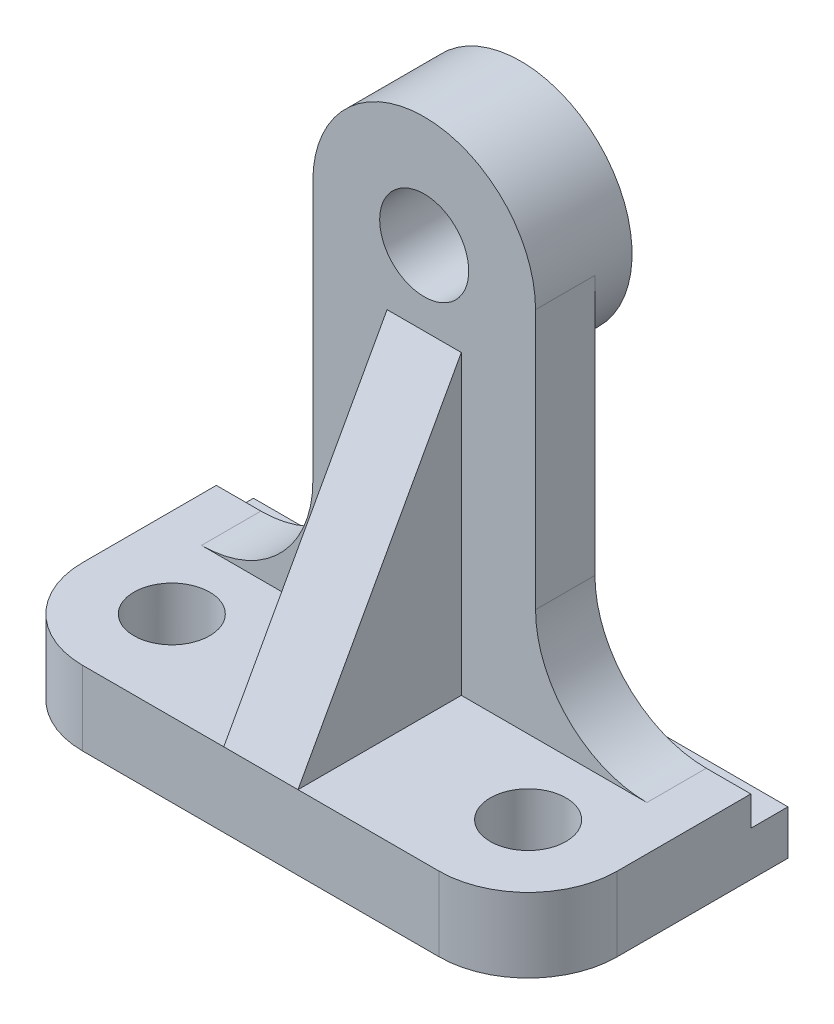
ISO-10303-21;
HEADER;
FILE_DESCRIPTION(('STEP AP214'),'2;1');
FILE_NAME('part.step','',(''),(''),'','','');
FILE_SCHEMA(('AUTOMOTIVE_DESIGN { 1 0 10303 214 1 1 1 1 }'));
ENDSEC;
DATA;
#1=APPLICATION_CONTEXT('core data for automotive mechanical design processes');
#2=APPLICATION_PROTOCOL_DEFINITION('international standard','automotive_design',2000,#1);
#3=PRODUCT_CONTEXT('',#1,'mechanical');
#4=PRODUCT('Part','Part','',(#3));
#5=PRODUCT_RELATED_PRODUCT_CATEGORY('part','',(#4));
#6=PRODUCT_DEFINITION_FORMATION('','',#4);
#7=PRODUCT_DEFINITION_CONTEXT('part definition',#1,'design');
#8=PRODUCT_DEFINITION('design','',#6,#7);
#9=PRODUCT_DEFINITION_SHAPE('','',#8);
#10=(LENGTH_UNIT() NAMED_UNIT(*) SI_UNIT(.MILLI.,.METRE.));
#11=(NAMED_UNIT(*) PLANE_ANGLE_UNIT() SI_UNIT($,.RADIAN.));
#12=(NAMED_UNIT(*) SI_UNIT($,.STERADIAN.) SOLID_ANGLE_UNIT());
#13=UNCERTAINTY_MEASURE_WITH_UNIT(LENGTH_MEASURE(1.E-05),#10,'distance_accuracy_value','');
#14=(GEOMETRIC_REPRESENTATION_CONTEXT(3) GLOBAL_UNCERTAINTY_ASSIGNED_CONTEXT((#13)) GLOBAL_UNIT_ASSIGNED_CONTEXT((#10,
#11,#12)) REPRESENTATION_CONTEXT('',''));
#15=CARTESIAN_POINT('',(0.,0.,0.));
#16=DIRECTION('',(0.,0.,1.));
#17=DIRECTION('',(1.,0.,0.));
#18=AXIS2_PLACEMENT_3D('',#15,#16,#17);
#19=CARTESIAN_POINT('',(0.,10.,0.));
#20=DIRECTION('',(0.,-1.,0.));
#21=DIRECTION('',(0.,0.,-1.));
#22=AXIS2_PLACEMENT_3D('',#19,#20,#21);
#23=PLANE('',#22);
#24=CARTESIAN_POINT('',(-24.,10.,5.5));
#25=DIRECTION('',(0.,1.,0.));
#26=DIRECTION('',(0.,0.,1.));
#27=AXIS2_PLACEMENT_3D('',#24,#25,#26);
#28=CIRCLE('',#27,5.09999999999999);
#29=CARTESIAN_POINT('',(-24.,10.,10.6));
#30=VERTEX_POINT('',#29);
#31=EDGE_CURVE('E197',#30,#30,#28,.T.);
#32=ORIENTED_EDGE('',*,*,#31,.F.);
#33=EDGE_LOOP('',(#32));
#34=FACE_BOUND('',#33,.T.);
#35=DIRECTION('',(0.,0.,1.));
#36=VECTOR('',#35,1.);
#37=CARTESIAN_POINT('',(-5.,10.,0.));
#38=LINE('',#37,#36);
#39=CARTESIAN_POINT('',(-5.,10.,-4.5));
#40=VERTEX_POINT('',#39);
#41=CARTESIAN_POINT('',(-5.,10.,17.5));
#42=VERTEX_POINT('',#41);
#43=EDGE_CURVE('E172',#40,#42,#38,.T.);
#44=ORIENTED_EDGE('',*,*,#43,.F.);
#45=DIRECTION('',(-1.,0.,0.));
#46=VECTOR('',#45,1.);
#47=CARTESIAN_POINT('',(15.,10.,-4.5));
#48=LINE('',#47,#46);
#49=CARTESIAN_POINT('',(-30.,10.,-4.5));
#50=VERTEX_POINT('',#49);
#51=EDGE_CURVE('E156',#40,#50,#48,.T.);
#52=ORIENTED_EDGE('',*,*,#51,.T.);
#53=DIRECTION('',(0.,0.,-1.));
#54=VECTOR('',#53,1.);
#55=CARTESIAN_POINT('',(-30.,10.,0.));
#56=LINE('',#55,#54);
#57=CARTESIAN_POINT('',(-30.,10.,-12.5));
#58=VERTEX_POINT('',#57);
#59=EDGE_CURVE('E298',#50,#58,#56,.T.);
#60=ORIENTED_EDGE('',*,*,#59,.T.);
#61=DIRECTION('',(1.,0.,0.));
#62=VECTOR('',#61,1.);
#63=CARTESIAN_POINT('',(-36.,10.,-12.5));
#64=LINE('',#63,#62);
#65=CARTESIAN_POINT('',(-36.,10.,-12.5));
#66=VERTEX_POINT('',#65);
#67=EDGE_CURVE('E250',#66,#58,#64,.T.);
#68=ORIENTED_EDGE('',*,*,#67,.F.);
#69=DIRECTION('',(0.,0.,1.));
#70=VECTOR('',#69,1.);
#71=CARTESIAN_POINT('',(-36.,10.,17.5));
#72=LINE('',#71,#70);
#73=CARTESIAN_POINT('',(-36.,10.,5.5));
#74=VERTEX_POINT('',#73);
#75=EDGE_CURVE('E256',#66,#74,#72,.T.);
#76=ORIENTED_EDGE('',*,*,#75,.T.);
#77=CARTESIAN_POINT('',(-24.,10.,5.5));
#78=DIRECTION('',(0.,-1.,0.));
#79=DIRECTION('',(0.,0.,-1.));
#80=AXIS2_PLACEMENT_3D('',#77,#78,#79);
#81=CIRCLE('',#80,12.);
#82=CARTESIAN_POINT('',(-24.,10.,17.5));
#83=VERTEX_POINT('',#82);
#84=EDGE_CURVE('E288',#74,#83,#81,.F.);
#85=ORIENTED_EDGE('',*,*,#84,.T.);
#86=DIRECTION('',(1.,0.,0.));
#87=VECTOR('',#86,1.);
#88=CARTESIAN_POINT('',(-36.,10.,17.5));
#89=LINE('',#88,#87);
#90=EDGE_CURVE('E173',#83,#42,#89,.T.);
#91=ORIENTED_EDGE('',*,*,#90,.T.);
#92=EDGE_LOOP('',(#44,#52,#60,#68,#76,#85,#91));
#93=FACE_BOUND('',#92,.T.);
#94=ADVANCED_FACE('F37',(#34,#93),#23,.F.);
#95=CARTESIAN_POINT('',(-36.,10.,-12.5));
#96=DIRECTION('',(0.,0.,1.));
#97=DIRECTION('',(1.,0.,0.));
#98=AXIS2_PLACEMENT_3D('',#95,#96,#97);
#99=PLANE('',#98);
#100=DIRECTION('',(0.,-1.,0.));
#101=VECTOR('',#100,1.);
#102=CARTESIAN_POINT('',(36.,10.,-12.5));
#103=LINE('',#102,#101);
#104=CARTESIAN_POINT('',(36.,10.,-12.5));
#105=VERTEX_POINT('',#104);
#106=CARTESIAN_POINT('',(36.,6.,-12.5));
#107=VERTEX_POINT('',#106);
#108=EDGE_CURVE('E230',#105,#107,#103,.T.);
#109=ORIENTED_EDGE('',*,*,#108,.T.);
#110=DIRECTION('',(1.,0.,0.));
#111=VECTOR('',#110,1.);
#112=CARTESIAN_POINT('',(-36.,6.,-12.5));
#113=LINE('',#112,#111);
#114=CARTESIAN_POINT('',(-36.,6.,-12.5));
#115=VERTEX_POINT('',#114);
#116=EDGE_CURVE('E248',#115,#107,#113,.T.);
#117=ORIENTED_EDGE('',*,*,#116,.F.);
#118=DIRECTION('',(0.,-1.,0.));
#119=VECTOR('',#118,1.);
#120=CARTESIAN_POINT('',(-36.,10.,-12.5));
#121=LINE('',#120,#119);
#122=EDGE_CURVE('E233',#66,#115,#121,.T.);
#123=ORIENTED_EDGE('',*,*,#122,.F.);
#124=ORIENTED_EDGE('',*,*,#67,.T.);
#125=CARTESIAN_POINT('',(-30.,25.,-12.5));
#126=DIRECTION('',(0.,0.,1.));
#127=DIRECTION('',(1.,0.,0.));
#128=AXIS2_PLACEMENT_3D('',#125,#126,#127);
#129=CIRCLE('',#128,15.);
#130=CARTESIAN_POINT('',(-15.,25.,-12.5));
#131=VERTEX_POINT('',#130);
#132=EDGE_CURVE('E305',#58,#131,#129,.T.);
#133=ORIENTED_EDGE('',*,*,#132,.T.);
#134=DIRECTION('',(0.,1.,0.));
#135=VECTOR('',#134,1.);
#136=CARTESIAN_POINT('',(-15.,10.,-12.5));
#137=LINE('',#136,#135);
#138=CARTESIAN_POINT('',(-15.,60.,-12.5));
#139=VERTEX_POINT('',#138);
#140=EDGE_CURVE('E215',#131,#139,#137,.T.);
#141=ORIENTED_EDGE('',*,*,#140,.T.);
#142=CARTESIAN_POINT('',(0.,60.,-12.5));
#143=DIRECTION('',(0.,0.,-1.));
#144=DIRECTION('',(-1.,0.,0.));
#145=AXIS2_PLACEMENT_3D('',#142,#143,#144);
#146=CIRCLE('',#145,15.);
#147=CARTESIAN_POINT('',(15.,60.,-12.5));
#148=VERTEX_POINT('',#147);
#149=EDGE_CURVE('E193',#148,#139,#146,.T.);
#150=ORIENTED_EDGE('',*,*,#149,.F.);
#151=DIRECTION('',(0.,-1.,0.));
#152=VECTOR('',#151,1.);
#153=CARTESIAN_POINT('',(15.,60.,-12.5));
#154=LINE('',#153,#152);
#155=CARTESIAN_POINT('',(15.,25.,-12.5));
#156=VERTEX_POINT('',#155);
#157=EDGE_CURVE('E213',#148,#156,#154,.T.);
#158=ORIENTED_EDGE('',*,*,#157,.T.);
#159=CARTESIAN_POINT('',(30.,25.,-12.5));
#160=DIRECTION('',(0.,0.,1.));
#161=DIRECTION('',(1.,0.,0.));
#162=AXIS2_PLACEMENT_3D('',#159,#160,#161);
#163=CIRCLE('',#162,15.);
#164=CARTESIAN_POINT('',(30.,10.,-12.5));
#165=VERTEX_POINT('',#164);
#166=EDGE_CURVE('E45',#156,#165,#163,.T.);
#167=ORIENTED_EDGE('',*,*,#166,.T.);
#168=EDGE_CURVE('E240',#165,#105,#64,.T.);
#169=ORIENTED_EDGE('',*,*,#168,.T.);
#170=EDGE_LOOP('',(#109,#117,#123,#124,#133,#141,#150,#158,#167,#169));
#171=FACE_BOUND('',#170,.T.);
#172=ADVANCED_FACE('F309',(#171),#99,.F.);
#173=CARTESIAN_POINT('',(24.,10.,5.5));
#174=DIRECTION('',(0.,1.,0.));
#175=DIRECTION('',(0.,0.,1.));
#176=AXIS2_PLACEMENT_3D('',#173,#174,#175);
#177=CIRCLE('',#176,5.09999999999999);
#178=CARTESIAN_POINT('',(24.,10.,10.6));
#179=VERTEX_POINT('',#178);
#180=EDGE_CURVE('E204',#179,#179,#177,.T.);
#181=ORIENTED_EDGE('',*,*,#180,.F.);
#182=EDGE_LOOP('',(#181));
#183=FACE_BOUND('',#182,.T.);
#184=CARTESIAN_POINT('',(30.,10.,-4.5));
#185=VERTEX_POINT('',#184);
#186=CARTESIAN_POINT('',(5.,10.,-4.5));
#187=VERTEX_POINT('',#186);
#188=EDGE_CURVE('E168',#185,#187,#48,.T.);
#189=ORIENTED_EDGE('',*,*,#188,.T.);
#190=DIRECTION('',(0.,0.,1.));
#191=VECTOR('',#190,1.);
#192=CARTESIAN_POINT('',(5.,10.,0.));
#193=LINE('',#192,#191);
#194=CARTESIAN_POINT('',(5.,10.,17.5));
#195=VERTEX_POINT('',#194);
#196=EDGE_CURVE('E52',#187,#195,#193,.T.);
#197=ORIENTED_EDGE('',*,*,#196,.T.);
#198=CARTESIAN_POINT('',(24.,10.,17.5));
#199=VERTEX_POINT('',#198);
#200=EDGE_CURVE('E259',#195,#199,#89,.T.);
#201=ORIENTED_EDGE('',*,*,#200,.T.);
#202=CARTESIAN_POINT('',(24.,10.,5.5));
#203=DIRECTION('',(0.,-1.,0.));
#204=DIRECTION('',(0.,0.,-1.));
#205=AXIS2_PLACEMENT_3D('',#202,#203,#204);
#206=CIRCLE('',#205,12.);
#207=CARTESIAN_POINT('',(36.,10.,5.5));
#208=VERTEX_POINT('',#207);
#209=EDGE_CURVE('E290',#199,#208,#206,.F.);
#210=ORIENTED_EDGE('',*,*,#209,.T.);
#211=DIRECTION('',(0.,0.,-1.));
#212=VECTOR('',#211,1.);
#213=CARTESIAN_POINT('',(36.,10.,17.5));
#214=LINE('',#213,#212);
#215=EDGE_CURVE('E253',#208,#105,#214,.T.);
#216=ORIENTED_EDGE('',*,*,#215,.T.);
#217=ORIENTED_EDGE('',*,*,#168,.F.);
#218=DIRECTION('',(0.,0.,-1.));
#219=VECTOR('',#218,1.);
#220=CARTESIAN_POINT('',(30.,10.,0.));
#221=LINE('',#220,#219);
#222=EDGE_CURVE('E295',#165,#185,#221,.F.);
#223=ORIENTED_EDGE('',*,*,#222,.T.);
#224=EDGE_LOOP('',(#189,#197,#201,#210,#216,#217,#223));
#225=FACE_BOUND('',#224,.T.);
#226=ADVANCED_FACE('F315',(#183,#225),#23,.F.);
#227=CARTESIAN_POINT('',(36.,10.,17.5));
#228=DIRECTION('',(-1.,0.,0.));
#229=DIRECTION('',(0.,0.,1.));
#230=AXIS2_PLACEMENT_3D('',#227,#228,#229);
#231=PLANE('',#230);
#232=DIRECTION('',(0.,-1.,0.));
#233=VECTOR('',#232,1.);
#234=CARTESIAN_POINT('',(36.,10.,-17.5));
#235=LINE('',#234,#233);
#236=CARTESIAN_POINT('',(36.,6.,-17.5));
#237=VERTEX_POINT('',#236);
#238=CARTESIAN_POINT('',(36.,0.,-17.5));
#239=VERTEX_POINT('',#238);
#240=EDGE_CURVE('E272',#237,#239,#235,.T.);
#241=ORIENTED_EDGE('',*,*,#240,.F.);
#242=DIRECTION('',(0.,0.,-1.));
#243=VECTOR('',#242,1.);
#244=CARTESIAN_POINT('',(36.,6.,-17.5));
#245=LINE('',#244,#243);
#246=EDGE_CURVE('E237',#107,#237,#245,.T.);
#247=ORIENTED_EDGE('',*,*,#246,.F.);
#248=ORIENTED_EDGE('',*,*,#108,.F.);
#249=ORIENTED_EDGE('',*,*,#215,.F.);
#250=DIRECTION('',(0.,-1.,0.));
#251=VECTOR('',#250,1.);
#252=CARTESIAN_POINT('',(36.,10.,5.5));
#253=LINE('',#252,#251);
#254=CARTESIAN_POINT('',(36.,0.,5.5));
#255=VERTEX_POINT('',#254);
#256=EDGE_CURVE('E274',#208,#255,#253,.T.);
#257=ORIENTED_EDGE('',*,*,#256,.T.);
#258=DIRECTION('',(0.,0.,-1.));
#259=VECTOR('',#258,1.);
#260=CARTESIAN_POINT('',(36.,0.,17.5));
#261=LINE('',#260,#259);
#262=EDGE_CURVE('E247',#255,#239,#261,.T.);
#263=ORIENTED_EDGE('',*,*,#262,.T.);
#264=EDGE_LOOP('',(#241,#247,#248,#249,#257,#263));
#265=FACE_BOUND('',#264,.T.);
#266=ADVANCED_FACE('F356',(#265),#231,.F.);
#267=CARTESIAN_POINT('',(-36.,10.,-17.5));
#268=DIRECTION('',(0.,0.,1.));
#269=DIRECTION('',(1.,0.,0.));
#270=AXIS2_PLACEMENT_3D('',#267,#268,#269);
#271=PLANE('',#270);
#272=DIRECTION('',(-1.,0.,0.));
#273=VECTOR('',#272,1.);
#274=CARTESIAN_POINT('',(-36.,0.,-17.5));
#275=LINE('',#274,#273);
#276=CARTESIAN_POINT('',(-36.,0.,-17.5));
#277=VERTEX_POINT('',#276);
#278=EDGE_CURVE('E264',#239,#277,#275,.T.);
#279=ORIENTED_EDGE('',*,*,#278,.T.);
#280=DIRECTION('',(0.,-1.,0.));
#281=VECTOR('',#280,1.);
#282=CARTESIAN_POINT('',(-36.,10.,-17.5));
#283=LINE('',#282,#281);
#284=CARTESIAN_POINT('',(-36.,6.,-17.5));
#285=VERTEX_POINT('',#284);
#286=EDGE_CURVE('E261',#285,#277,#283,.T.);
#287=ORIENTED_EDGE('',*,*,#286,.F.);
#288=DIRECTION('',(1.,0.,0.));
#289=VECTOR('',#288,1.);
#290=CARTESIAN_POINT('',(-36.,6.,-17.5));
#291=LINE('',#290,#289);
#292=EDGE_CURVE('E245',#285,#237,#291,.T.);
#293=ORIENTED_EDGE('',*,*,#292,.T.);
#294=ORIENTED_EDGE('',*,*,#240,.T.);
#295=EDGE_LOOP('',(#279,#287,#293,#294));
#296=FACE_BOUND('',#295,.T.);
#297=ADVANCED_FACE('F351',(#296),#271,.F.);
#298=CARTESIAN_POINT('',(-36.,10.,17.5));
#299=DIRECTION('',(1.,0.,0.));
#300=DIRECTION('',(0.,0.,-1.));
#301=AXIS2_PLACEMENT_3D('',#298,#299,#300);
#302=PLANE('',#301);
#303=ORIENTED_EDGE('',*,*,#122,.T.);
#304=DIRECTION('',(0.,0.,-1.));
#305=VECTOR('',#304,1.);
#306=CARTESIAN_POINT('',(-36.,6.,-17.5));
#307=LINE('',#306,#305);
#308=EDGE_CURVE('E236',#115,#285,#307,.T.);
#309=ORIENTED_EDGE('',*,*,#308,.T.);
#310=ORIENTED_EDGE('',*,*,#286,.T.);
#311=DIRECTION('',(0.,0.,1.));
#312=VECTOR('',#311,1.);
#313=CARTESIAN_POINT('',(-36.,0.,17.5));
#314=LINE('',#313,#312);
#315=CARTESIAN_POINT('',(-36.,0.,5.5));
#316=VERTEX_POINT('',#315);
#317=EDGE_CURVE('E266',#277,#316,#314,.T.);
#318=ORIENTED_EDGE('',*,*,#317,.T.);
#319=DIRECTION('',(0.,-1.,0.));
#320=VECTOR('',#319,1.);
#321=CARTESIAN_POINT('',(-36.,10.,5.5));
#322=LINE('',#321,#320);
#323=EDGE_CURVE('E292',#316,#74,#322,.F.);
#324=ORIENTED_EDGE('',*,*,#323,.T.);
#325=ORIENTED_EDGE('',*,*,#75,.F.);
#326=EDGE_LOOP('',(#303,#309,#310,#318,#324,#325));
#327=FACE_BOUND('',#326,.T.);
#328=ADVANCED_FACE('F336',(#327),#302,.F.);
#329=CARTESIAN_POINT('',(-36.,10.,17.5));
#330=DIRECTION('',(0.,0.,-1.));
#331=DIRECTION('',(-1.,0.,0.));
#332=AXIS2_PLACEMENT_3D('',#329,#330,#331);
#333=PLANE('',#332);
#334=ORIENTED_EDGE('',*,*,#200,.F.);
#335=DIRECTION('',(1.,0.,0.));
#336=VECTOR('',#335,1.);
#337=CARTESIAN_POINT('',(-36.,10.,17.5));
#338=LINE('',#337,#336);
#339=EDGE_CURVE('E59',#42,#195,#338,.T.);
#340=ORIENTED_EDGE('',*,*,#339,.F.);
#341=ORIENTED_EDGE('',*,*,#90,.F.);
#342=DIRECTION('',(0.,-1.,0.));
#343=VECTOR('',#342,1.);
#344=CARTESIAN_POINT('',(-24.,10.,17.5));
#345=LINE('',#344,#343);
#346=CARTESIAN_POINT('',(-24.,0.,17.5));
#347=VERTEX_POINT('',#346);
#348=EDGE_CURVE('E282',#83,#347,#345,.T.);
#349=ORIENTED_EDGE('',*,*,#348,.T.);
#350=DIRECTION('',(1.,0.,0.));
#351=VECTOR('',#350,1.);
#352=CARTESIAN_POINT('',(-36.,0.,17.5));
#353=LINE('',#352,#351);
#354=CARTESIAN_POINT('',(24.,0.,17.5));
#355=VERTEX_POINT('',#354);
#356=EDGE_CURVE('E257',#347,#355,#353,.T.);
#357=ORIENTED_EDGE('',*,*,#356,.T.);
#358=DIRECTION('',(0.,-1.,0.));
#359=VECTOR('',#358,1.);
#360=CARTESIAN_POINT('',(24.,10.,17.5));
#361=LINE('',#360,#359);
#362=EDGE_CURVE('E285',#355,#199,#361,.F.);
#363=ORIENTED_EDGE('',*,*,#362,.T.);
#364=EDGE_LOOP('',(#334,#340,#341,#349,#357,#363));
#365=FACE_BOUND('',#364,.T.);
#366=ADVANCED_FACE('F342',(#365),#333,.F.);
#367=CARTESIAN_POINT('',(0.,0.,0.));
#368=DIRECTION('',(0.,-1.,0.));
#369=DIRECTION('',(0.,0.,-1.));
#370=AXIS2_PLACEMENT_3D('',#367,#368,#369);
#371=PLANE('',#370);
#372=CARTESIAN_POINT('',(24.,0.,5.5));
#373=DIRECTION('',(0.,-1.,0.));
#374=DIRECTION('',(0.,0.,-1.));
#375=AXIS2_PLACEMENT_3D('',#372,#373,#374);
#376=CIRCLE('',#375,12.);
#377=EDGE_CURVE('E279',#255,#355,#376,.T.);
#378=ORIENTED_EDGE('',*,*,#377,.T.);
#379=ORIENTED_EDGE('',*,*,#356,.F.);
#380=CARTESIAN_POINT('',(-24.,0.,5.5));
#381=DIRECTION('',(0.,-1.,0.));
#382=DIRECTION('',(0.,0.,-1.));
#383=AXIS2_PLACEMENT_3D('',#380,#381,#382);
#384=CIRCLE('',#383,12.);
#385=EDGE_CURVE('E277',#347,#316,#384,.T.);
#386=ORIENTED_EDGE('',*,*,#385,.T.);
#387=ORIENTED_EDGE('',*,*,#317,.F.);
#388=ORIENTED_EDGE('',*,*,#278,.F.);
#389=ORIENTED_EDGE('',*,*,#262,.F.);
#390=EDGE_LOOP('',(#378,#379,#386,#387,#388,#389));
#391=FACE_BOUND('',#390,.T.);
#392=CARTESIAN_POINT('',(24.,0.,5.5));
#393=DIRECTION('',(0.,-1.,0.));
#394=DIRECTION('',(0.,0.,-1.));
#395=AXIS2_PLACEMENT_3D('',#392,#393,#394);
#396=CIRCLE('',#395,5.09999999999999);
#397=CARTESIAN_POINT('',(24.,0.,0.40000000000001));
#398=VERTEX_POINT('',#397);
#399=EDGE_CURVE('E207',#398,#398,#396,.T.);
#400=ORIENTED_EDGE('',*,*,#399,.F.);
#401=EDGE_LOOP('',(#400));
#402=FACE_BOUND('',#401,.T.);
#403=CARTESIAN_POINT('',(-24.,0.,5.5));
#404=DIRECTION('',(0.,-1.,0.));
#405=DIRECTION('',(0.,0.,-1.));
#406=AXIS2_PLACEMENT_3D('',#403,#404,#405);
#407=CIRCLE('',#406,5.09999999999999);
#408=CARTESIAN_POINT('',(-24.,0.,0.40000000000001));
#409=VERTEX_POINT('',#408);
#410=EDGE_CURVE('E201',#409,#409,#407,.T.);
#411=ORIENTED_EDGE('',*,*,#410,.F.);
#412=EDGE_LOOP('',(#411));
#413=FACE_BOUND('',#412,.T.);
#414=ADVANCED_FACE('F347',(#391,#402,#413),#371,.T.);
#415=CARTESIAN_POINT('',(24.,10.,5.5));
#416=DIRECTION('',(0.,-1.,0.));
#417=DIRECTION('',(0.,0.,-1.));
#418=AXIS2_PLACEMENT_3D('',#415,#416,#417);
#419=CYLINDRICAL_SURFACE('',#418,12.);
#420=ORIENTED_EDGE('',*,*,#209,.F.);
#421=ORIENTED_EDGE('',*,*,#362,.F.);
#422=ORIENTED_EDGE('',*,*,#377,.F.);
#423=ORIENTED_EDGE('',*,*,#256,.F.);
#424=EDGE_LOOP('',(#420,#421,#422,#423));
#425=FACE_BOUND('',#424,.T.);
#426=ADVANCED_FACE('F361',(#425),#419,.T.);
#427=CARTESIAN_POINT('',(-24.,10.,5.5));
#428=DIRECTION('',(0.,-1.,0.));
#429=DIRECTION('',(0.,0.,-1.));
#430=AXIS2_PLACEMENT_3D('',#427,#428,#429);
#431=CYLINDRICAL_SURFACE('',#430,12.);
#432=ORIENTED_EDGE('',*,*,#84,.F.);
#433=ORIENTED_EDGE('',*,*,#323,.F.);
#434=ORIENTED_EDGE('',*,*,#385,.F.);
#435=ORIENTED_EDGE('',*,*,#348,.F.);
#436=EDGE_LOOP('',(#432,#433,#434,#435));
#437=FACE_BOUND('',#436,.T.);
#438=ADVANCED_FACE('F344',(#437),#431,.T.);
#439=CARTESIAN_POINT('',(-36.,6.,-17.5));
#440=DIRECTION('',(0.,-1.,0.));
#441=DIRECTION('',(0.,0.,-1.));
#442=AXIS2_PLACEMENT_3D('',#439,#440,#441);
#443=PLANE('',#442);
#444=ORIENTED_EDGE('',*,*,#246,.T.);
#445=ORIENTED_EDGE('',*,*,#292,.F.);
#446=ORIENTED_EDGE('',*,*,#308,.F.);
#447=ORIENTED_EDGE('',*,*,#116,.T.);
#448=EDGE_LOOP('',(#444,#445,#446,#447));
#449=FACE_BOUND('',#448,.T.);
#450=ADVANCED_FACE('F428',(#449),#443,.F.);
#451=CARTESIAN_POINT('',(15.,60.,-4.5));
#452=DIRECTION('',(1.,0.,0.));
#453=DIRECTION('',(0.,1.,0.));
#454=AXIS2_PLACEMENT_3D('',#451,#452,#453);
#455=PLANE('',#454);
#456=DIRECTION('',(0.,-1.,0.));
#457=VECTOR('',#456,1.);
#458=CARTESIAN_POINT('',(15.,60.,-4.5));
#459=LINE('',#458,#457);
#460=CARTESIAN_POINT('',(15.,60.,-4.5));
#461=VERTEX_POINT('',#460);
#462=CARTESIAN_POINT('',(15.,25.,-4.5));
#463=VERTEX_POINT('',#462);
#464=EDGE_CURVE('E169',#461,#463,#459,.T.);
#465=ORIENTED_EDGE('',*,*,#464,.T.);
#466=DIRECTION('',(0.,0.,-1.));
#467=VECTOR('',#466,1.);
#468=CARTESIAN_POINT('',(15.,25.,-4.5));
#469=LINE('',#468,#467);
#470=EDGE_CURVE('E302',#463,#156,#469,.T.);
#471=ORIENTED_EDGE('',*,*,#470,.T.);
#472=ORIENTED_EDGE('',*,*,#157,.F.);
#473=DIRECTION('',(0.,0.,-1.));
#474=VECTOR('',#473,1.);
#475=CARTESIAN_POINT('',(15.,60.,-4.5));
#476=LINE('',#475,#474);
#477=EDGE_CURVE('E227',#461,#148,#476,.T.);
#478=ORIENTED_EDGE('',*,*,#477,.F.);
#479=EDGE_LOOP('',(#465,#471,#472,#478));
#480=FACE_BOUND('',#479,.T.);
#481=ADVANCED_FACE('F321',(#480),#455,.T.);
#482=CARTESIAN_POINT('',(0.,60.,-4.5));
#483=DIRECTION('',(0.,0.,-1.));
#484=DIRECTION('',(-1.,0.,0.));
#485=AXIS2_PLACEMENT_3D('',#482,#483,#484);
#486=CYLINDRICAL_SURFACE('',#485,15.);
#487=ORIENTED_EDGE('',*,*,#149,.T.);
#488=DIRECTION('',(0.,0.,-1.));
#489=VECTOR('',#488,1.);
#490=CARTESIAN_POINT('',(-15.,60.,-4.5));
#491=LINE('',#490,#489);
#492=CARTESIAN_POINT('',(-15.,60.,-4.5));
#493=VERTEX_POINT('',#492);
#494=EDGE_CURVE('E222',#493,#139,#491,.T.);
#495=ORIENTED_EDGE('',*,*,#494,.F.);
#496=CARTESIAN_POINT('',(0.,60.,-4.5));
#497=DIRECTION('',(0.,0.,-1.));
#498=DIRECTION('',(-1.,0.,0.));
#499=AXIS2_PLACEMENT_3D('',#496,#497,#498);
#500=CIRCLE('',#499,15.);
#501=EDGE_CURVE('E219',#493,#461,#500,.T.);
#502=ORIENTED_EDGE('',*,*,#501,.T.);
#503=ORIENTED_EDGE('',*,*,#477,.T.);
#504=EDGE_LOOP('',(#487,#495,#502,#503));
#505=FACE_BOUND('',#504,.T.);
#506=CARTESIAN_POINT('',(0.,60.,-17.5));
#507=DIRECTION('',(0.,0.,-1.));
#508=DIRECTION('',(-1.,0.,0.));
#509=AXIS2_PLACEMENT_3D('',#506,#507,#508);
#510=CIRCLE('',#509,15.);
#511=CARTESIAN_POINT('',(-15.,60.,-17.5));
#512=VERTEX_POINT('',#511);
#513=EDGE_CURVE('E194',#512,#512,#510,.T.);
#514=ORIENTED_EDGE('',*,*,#513,.F.);
#515=EDGE_LOOP('',(#514));
#516=FACE_BOUND('',#515,.T.);
#517=ADVANCED_FACE('F323',(#505,#516),#486,.T.);
#518=CARTESIAN_POINT('',(-15.,10.,-4.5));
#519=DIRECTION('',(-1.,0.,0.));
#520=DIRECTION('',(0.,0.,1.));
#521=AXIS2_PLACEMENT_3D('',#518,#519,#520);
#522=PLANE('',#521);
#523=ORIENTED_EDGE('',*,*,#140,.F.);
#524=DIRECTION('',(0.,0.,-1.));
#525=VECTOR('',#524,1.);
#526=CARTESIAN_POINT('',(-15.,25.,-4.5));
#527=LINE('',#526,#525);
#528=CARTESIAN_POINT('',(-15.,25.,-4.5));
#529=VERTEX_POINT('',#528);
#530=EDGE_CURVE('E300',#131,#529,#527,.F.);
#531=ORIENTED_EDGE('',*,*,#530,.T.);
#532=DIRECTION('',(0.,1.,0.));
#533=VECTOR('',#532,1.);
#534=CARTESIAN_POINT('',(-15.,10.,-4.5));
#535=LINE('',#534,#533);
#536=EDGE_CURVE('E217',#529,#493,#535,.T.);
#537=ORIENTED_EDGE('',*,*,#536,.T.);
#538=ORIENTED_EDGE('',*,*,#494,.T.);
#539=EDGE_LOOP('',(#523,#531,#537,#538));
#540=FACE_BOUND('',#539,.T.);
#541=ADVANCED_FACE('F329',(#540),#522,.T.);
#542=CARTESIAN_POINT('',(0.,60.,-4.5));
#543=DIRECTION('',(0.,0.,-1.));
#544=DIRECTION('',(-1.,0.,0.));
#545=AXIS2_PLACEMENT_3D('',#542,#543,#544);
#546=PLANE('',#545);
#547=CARTESIAN_POINT('',(0.,60.,-4.5));
#548=DIRECTION('',(0.,0.,-1.));
#549=DIRECTION('',(-1.,0.,0.));
#550=AXIS2_PLACEMENT_3D('',#547,#548,#549);
#551=CIRCLE('',#550,6.);
#552=CARTESIAN_POINT('',(-6.,60.,-4.5));
#553=VERTEX_POINT('',#552);
#554=EDGE_CURVE('E210',#553,#553,#551,.T.);
#555=ORIENTED_EDGE('',*,*,#554,.T.);
#556=EDGE_LOOP('',(#555));
#557=FACE_BOUND('',#556,.T.);
#558=DIRECTION('',(1.,0.,0.));
#559=VECTOR('',#558,1.);
#560=CARTESIAN_POINT('',(0.,50.,-4.5));
#561=LINE('',#560,#559);
#562=CARTESIAN_POINT('',(-5.,50.,-4.5));
#563=VERTEX_POINT('',#562);
#564=CARTESIAN_POINT('',(5.,50.,-4.5));
#565=VERTEX_POINT('',#564);
#566=EDGE_CURVE('E187',#563,#565,#561,.T.);
#567=ORIENTED_EDGE('',*,*,#566,.T.);
#568=DIRECTION('',(0.,-1.,0.));
#569=VECTOR('',#568,1.);
#570=CARTESIAN_POINT('',(5.,60.,-4.5));
#571=LINE('',#570,#569);
#572=EDGE_CURVE('E182',#565,#187,#571,.T.);
#573=ORIENTED_EDGE('',*,*,#572,.T.);
#574=ORIENTED_EDGE('',*,*,#188,.F.);
#575=CARTESIAN_POINT('',(30.,25.,-4.5));
#576=DIRECTION('',(0.,0.,-1.));
#577=DIRECTION('',(-1.,0.,0.));
#578=AXIS2_PLACEMENT_3D('',#575,#576,#577);
#579=CIRCLE('',#578,15.);
#580=EDGE_CURVE('E11',#185,#463,#579,.T.);
#581=ORIENTED_EDGE('',*,*,#580,.T.);
#582=ORIENTED_EDGE('',*,*,#464,.F.);
#583=ORIENTED_EDGE('',*,*,#501,.F.);
#584=ORIENTED_EDGE('',*,*,#536,.F.);
#585=CARTESIAN_POINT('',(-30.,25.,-4.5));
#586=DIRECTION('',(0.,0.,-1.));
#587=DIRECTION('',(-1.,0.,0.));
#588=AXIS2_PLACEMENT_3D('',#585,#586,#587);
#589=CIRCLE('',#588,15.);
#590=EDGE_CURVE('E164',#529,#50,#589,.T.);
#591=ORIENTED_EDGE('',*,*,#590,.T.);
#592=ORIENTED_EDGE('',*,*,#51,.F.);
#593=DIRECTION('',(0.,-1.,0.));
#594=VECTOR('',#593,1.);
#595=CARTESIAN_POINT('',(-5.,60.,-4.5));
#596=LINE('',#595,#594);
#597=EDGE_CURVE('E160',#563,#40,#596,.T.);
#598=ORIENTED_EDGE('',*,*,#597,.F.);
#599=EDGE_LOOP('',(#567,#573,#574,#581,#582,#583,#584,#591,#592,#598));
#600=FACE_BOUND('',#599,.T.);
#601=ADVANCED_FACE('F158',(#557,#600),#546,.F.);
#602=CARTESIAN_POINT('',(0.,60.,-4.5));
#603=DIRECTION('',(0.,0.,-1.));
#604=DIRECTION('',(-1.,0.,0.));
#605=AXIS2_PLACEMENT_3D('',#602,#603,#604);
#606=CYLINDRICAL_SURFACE('',#605,6.);
#607=CARTESIAN_POINT('',(0.,60.,-17.5));
#608=DIRECTION('',(0.,0.,-1.));
#609=DIRECTION('',(-1.,0.,0.));
#610=AXIS2_PLACEMENT_3D('',#607,#608,#609);
#611=CIRCLE('',#610,6.);
#612=CARTESIAN_POINT('',(-6.,60.,-17.5));
#613=VERTEX_POINT('',#612);
#614=EDGE_CURVE('E190',#613,#613,#611,.T.);
#615=ORIENTED_EDGE('',*,*,#614,.T.);
#616=EDGE_LOOP('',(#615));
#617=FACE_BOUND('',#616,.T.);
#618=ORIENTED_EDGE('',*,*,#554,.F.);
#619=EDGE_LOOP('',(#618));
#620=FACE_BOUND('',#619,.T.);
#621=ADVANCED_FACE('F415',(#617,#620),#606,.F.);
#622=CARTESIAN_POINT('',(-30.,25.,0.));
#623=DIRECTION('',(0.,0.,-1.));
#624=DIRECTION('',(-1.,0.,0.));
#625=AXIS2_PLACEMENT_3D('',#622,#623,#624);
#626=CYLINDRICAL_SURFACE('',#625,15.);
#627=ORIENTED_EDGE('',*,*,#590,.F.);
#628=ORIENTED_EDGE('',*,*,#530,.F.);
#629=ORIENTED_EDGE('',*,*,#132,.F.);
#630=ORIENTED_EDGE('',*,*,#59,.F.);
#631=EDGE_LOOP('',(#627,#628,#629,#630));
#632=FACE_BOUND('',#631,.T.);
#633=ADVANCED_FACE('F331',(#632),#626,.F.);
#634=CARTESIAN_POINT('',(30.,25.,-4.5));
#635=DIRECTION('',(0.,0.,-1.));
#636=DIRECTION('',(-1.,0.,0.));
#637=AXIS2_PLACEMENT_3D('',#634,#635,#636);
#638=CYLINDRICAL_SURFACE('',#637,15.);
#639=ORIENTED_EDGE('',*,*,#580,.F.);
#640=ORIENTED_EDGE('',*,*,#222,.F.);
#641=ORIENTED_EDGE('',*,*,#166,.F.);
#642=ORIENTED_EDGE('',*,*,#470,.F.);
#643=EDGE_LOOP('',(#639,#640,#641,#642));
#644=FACE_BOUND('',#643,.T.);
#645=ADVANCED_FACE('F39',(#644),#638,.F.);
#646=CARTESIAN_POINT('',(24.,10.,5.5));
#647=DIRECTION('',(0.,1.,0.));
#648=DIRECTION('',(0.,0.,1.));
#649=AXIS2_PLACEMENT_3D('',#646,#647,#648);
#650=CYLINDRICAL_SURFACE('',#649,5.09999999999999);
#651=ORIENTED_EDGE('',*,*,#180,.T.);
#652=EDGE_LOOP('',(#651));
#653=FACE_BOUND('',#652,.T.);
#654=ORIENTED_EDGE('',*,*,#399,.T.);
#655=EDGE_LOOP('',(#654));
#656=FACE_BOUND('',#655,.T.);
#657=ADVANCED_FACE('F396',(#653,#656),#650,.F.);
#658=CARTESIAN_POINT('',(-24.,10.,5.5));
#659=DIRECTION('',(0.,1.,0.));
#660=DIRECTION('',(0.,0.,1.));
#661=AXIS2_PLACEMENT_3D('',#658,#659,#660);
#662=CYLINDRICAL_SURFACE('',#661,5.09999999999999);
#663=ORIENTED_EDGE('',*,*,#31,.T.);
#664=EDGE_LOOP('',(#663));
#665=FACE_BOUND('',#664,.T.);
#666=ORIENTED_EDGE('',*,*,#410,.T.);
#667=EDGE_LOOP('',(#666));
#668=FACE_BOUND('',#667,.T.);
#669=ADVANCED_FACE('F399',(#665,#668),#662,.F.);
#670=CARTESIAN_POINT('',(0.,60.,-17.5));
#671=DIRECTION('',(0.,0.,-1.));
#672=DIRECTION('',(-1.,0.,0.));
#673=AXIS2_PLACEMENT_3D('',#670,#671,#672);
#674=PLANE('',#673);
#675=ORIENTED_EDGE('',*,*,#614,.F.);
#676=EDGE_LOOP('',(#675));
#677=FACE_BOUND('',#676,.T.);
#678=ORIENTED_EDGE('',*,*,#513,.T.);
#679=EDGE_LOOP('',(#678));
#680=FACE_BOUND('',#679,.T.);
#681=ADVANCED_FACE('F377',(#677,#680),#674,.T.);
#682=CARTESIAN_POINT('',(0.,50.,-4.5));
#683=DIRECTION('',(0.,0.481918749772156,0.876215908676647));
#684=DIRECTION('',(0.,-0.876215908676647,0.481918749772156));
#685=AXIS2_PLACEMENT_3D('',#682,#683,#684);
#686=PLANE('',#685);
#687=DIRECTION('',(0.,-0.876215908676647,0.481918749772156));
#688=VECTOR('',#687,1.);
#689=CARTESIAN_POINT('',(-5.,50.,-4.5));
#690=LINE('',#689,#688);
#691=EDGE_CURVE('E180',#563,#42,#690,.T.);
#692=ORIENTED_EDGE('',*,*,#691,.T.);
#693=ORIENTED_EDGE('',*,*,#339,.T.);
#694=DIRECTION('',(0.,-0.876215908676647,0.481918749772156));
#695=VECTOR('',#694,1.);
#696=CARTESIAN_POINT('',(5.,50.,-4.5));
#697=LINE('',#696,#695);
#698=EDGE_CURVE('E177',#565,#195,#697,.T.);
#699=ORIENTED_EDGE('',*,*,#698,.F.);
#700=ORIENTED_EDGE('',*,*,#566,.F.);
#701=EDGE_LOOP('',(#692,#693,#699,#700));
#702=FACE_BOUND('',#701,.T.);
#703=ADVANCED_FACE('F365',(#702),#686,.T.);
#704=CARTESIAN_POINT('',(5.,37.5,0.));
#705=DIRECTION('',(1.,0.,0.));
#706=DIRECTION('',(0.,0.,-1.));
#707=AXIS2_PLACEMENT_3D('',#704,#705,#706);
#708=PLANE('',#707);
#709=ORIENTED_EDGE('',*,*,#572,.F.);
#710=ORIENTED_EDGE('',*,*,#698,.T.);
#711=ORIENTED_EDGE('',*,*,#196,.F.);
#712=EDGE_LOOP('',(#709,#710,#711));
#713=FACE_BOUND('',#712,.T.);
#714=ADVANCED_FACE('F368',(#713),#708,.T.);
#715=CARTESIAN_POINT('',(-5.,37.5,0.));
#716=DIRECTION('',(1.,0.,0.));
#717=DIRECTION('',(0.,0.,-1.));
#718=AXIS2_PLACEMENT_3D('',#715,#716,#717);
#719=PLANE('',#718);
#720=ORIENTED_EDGE('',*,*,#691,.F.);
#721=ORIENTED_EDGE('',*,*,#597,.T.);
#722=ORIENTED_EDGE('',*,*,#43,.T.);
#723=EDGE_LOOP('',(#720,#721,#722));
#724=FACE_BOUND('',#723,.T.);
#725=ADVANCED_FACE('F179',(#724),#719,.F.);
#726=CLOSED_SHELL('',(#94,#172,#226,#266,#297,#328,#366,#414,#426,#438,#450,#481,#517,#541,#601,
#621,#633,#645,#657,#669,#681,#703,#714,#725));
#727=MANIFOLD_SOLID_BREP('B2',#726);
#728=ADVANCED_BREP_SHAPE_REPRESENTATION('',(#18,#727),#14);
#729=SHAPE_DEFINITION_REPRESENTATION(#9,#728);
ENDSEC;
END-ISO-10303-21;
